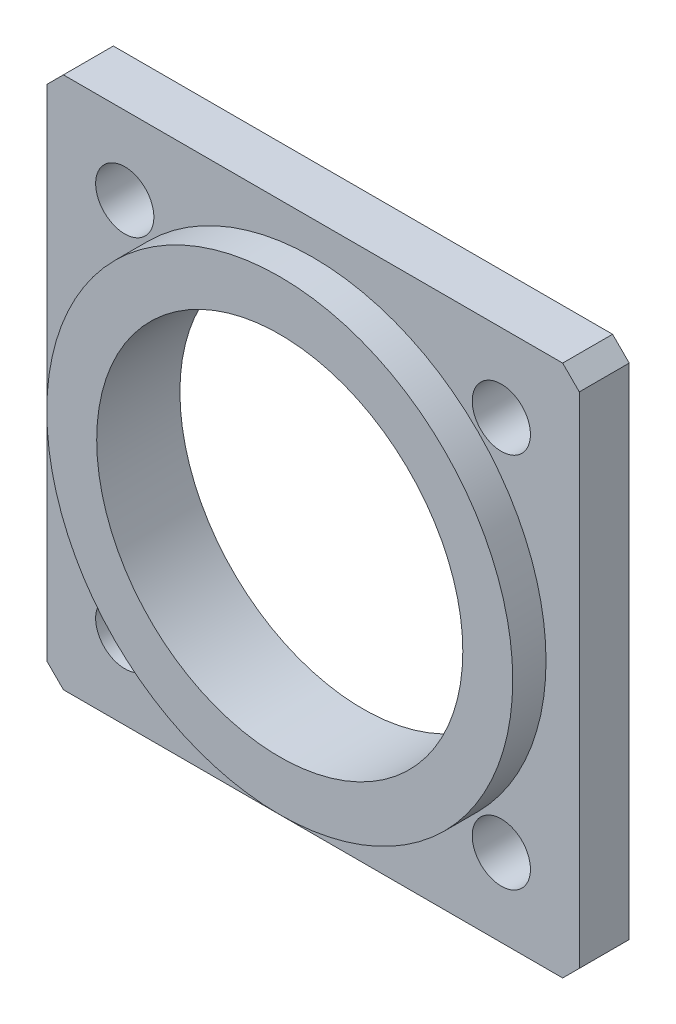
ISO-10303-21;
HEADER;
FILE_DESCRIPTION(('STEP AP214'),'2;1');
FILE_NAME('part.step','',(''),(''),'','','');
FILE_SCHEMA(('AUTOMOTIVE_DESIGN { 1 0 10303 214 1 1 1 1 }'));
ENDSEC;
DATA;
#1=APPLICATION_CONTEXT('core data for automotive mechanical design processes');
#2=APPLICATION_PROTOCOL_DEFINITION('international standard','automotive_design',2000,#1);
#3=PRODUCT_CONTEXT('',#1,'mechanical');
#4=PRODUCT('Part','Part','',(#3));
#5=PRODUCT_RELATED_PRODUCT_CATEGORY('part','',(#4));
#6=PRODUCT_DEFINITION_FORMATION('','',#4);
#7=PRODUCT_DEFINITION_CONTEXT('part definition',#1,'design');
#8=PRODUCT_DEFINITION('design','',#6,#7);
#9=PRODUCT_DEFINITION_SHAPE('','',#8);
#10=(LENGTH_UNIT() NAMED_UNIT(*) SI_UNIT(.MILLI.,.METRE.));
#11=(NAMED_UNIT(*) PLANE_ANGLE_UNIT() SI_UNIT($,.RADIAN.));
#12=(NAMED_UNIT(*) SI_UNIT($,.STERADIAN.) SOLID_ANGLE_UNIT());
#13=UNCERTAINTY_MEASURE_WITH_UNIT(LENGTH_MEASURE(1.E-05),#10,'distance_accuracy_value','');
#14=(GEOMETRIC_REPRESENTATION_CONTEXT(3) GLOBAL_UNCERTAINTY_ASSIGNED_CONTEXT((#13)) GLOBAL_UNIT_ASSIGNED_CONTEXT((#10,
#11,#12)) REPRESENTATION_CONTEXT('',''));
#15=CARTESIAN_POINT('',(0.,0.,0.));
#16=DIRECTION('',(0.,0.,1.));
#17=DIRECTION('',(1.,0.,0.));
#18=AXIS2_PLACEMENT_3D('',#15,#16,#17);
#19=CARTESIAN_POINT('',(0.,0.,5.));
#20=DIRECTION('',(0.,0.,-1.));
#21=DIRECTION('',(-1.,0.,0.));
#22=AXIS2_PLACEMENT_3D('',#19,#20,#21);
#23=CYLINDRICAL_SURFACE('',#22,14.);
#24=CARTESIAN_POINT('',(0.,0.,5.));
#25=DIRECTION('',(0.,0.,-1.));
#26=DIRECTION('',(-1.,0.,0.));
#27=AXIS2_PLACEMENT_3D('',#24,#25,#26);
#28=CIRCLE('',#27,14.);
#29=CARTESIAN_POINT('',(-14.,0.,5.));
#30=VERTEX_POINT('',#29);
#31=EDGE_CURVE('E20',#30,#30,#28,.F.);
#32=ORIENTED_EDGE('',*,*,#31,.F.);
#33=EDGE_LOOP('',(#32));
#34=FACE_BOUND('',#33,.T.);
#35=CARTESIAN_POINT('',(0.,0.,3.));
#36=DIRECTION('',(0.,0.,-1.));
#37=DIRECTION('',(-1.,0.,0.));
#38=AXIS2_PLACEMENT_3D('',#35,#36,#37);
#39=CIRCLE('',#38,14.);
#40=CARTESIAN_POINT('',(-14.,0.,3.));
#41=VERTEX_POINT('',#40);
#42=EDGE_CURVE('E95',#41,#41,#39,.F.);
#43=ORIENTED_EDGE('',*,*,#42,.T.);
#44=EDGE_LOOP('',(#43));
#45=FACE_BOUND('',#44,.T.);
#46=ADVANCED_FACE('F17',(#34,#45),#23,.T.);
#47=CARTESIAN_POINT('',(0.,0.,5.));
#48=DIRECTION('',(0.,0.,1.));
#49=DIRECTION('',(1.,0.,0.));
#50=AXIS2_PLACEMENT_3D('',#47,#48,#49);
#51=PLANE('',#50);
#52=ORIENTED_EDGE('',*,*,#31,.T.);
#53=EDGE_LOOP('',(#52));
#54=FACE_BOUND('',#53,.T.);
#55=CARTESIAN_POINT('',(0.,0.,5.));
#56=DIRECTION('',(0.,0.,1.));
#57=DIRECTION('',(1.,0.,0.));
#58=AXIS2_PLACEMENT_3D('',#55,#56,#57);
#59=CIRCLE('',#58,11.);
#60=CARTESIAN_POINT('',(11.,0.,5.));
#61=VERTEX_POINT('',#60);
#62=EDGE_CURVE('E118',#61,#61,#59,.F.);
#63=ORIENTED_EDGE('',*,*,#62,.T.);
#64=EDGE_LOOP('',(#63));
#65=FACE_BOUND('',#64,.T.);
#66=ADVANCED_FACE('F312',(#54,#65),#51,.T.);
#67=CARTESIAN_POINT('',(-16.,15.,3.));
#68=DIRECTION('',(0.707106781186548,-0.707106781186548,0.));
#69=DIRECTION('',(0.707106781186548,0.707106781186548,0.));
#70=AXIS2_PLACEMENT_3D('',#67,#68,#69);
#71=PLANE('',#70);
#72=DIRECTION('',(0.,0.,-1.));
#73=VECTOR('',#72,1.);
#74=CARTESIAN_POINT('',(-15.,16.,3.));
#75=LINE('',#74,#73);
#76=CARTESIAN_POINT('',(-15.,16.,3.));
#77=VERTEX_POINT('',#76);
#78=CARTESIAN_POINT('',(-15.,16.,0.));
#79=VERTEX_POINT('',#78);
#80=EDGE_CURVE('E104',#77,#79,#75,.T.);
#81=ORIENTED_EDGE('',*,*,#80,.T.);
#82=DIRECTION('',(0.707106781186548,0.707106781186548,0.));
#83=VECTOR('',#82,1.);
#84=CARTESIAN_POINT('',(-16.,15.,0.));
#85=LINE('',#84,#83);
#86=CARTESIAN_POINT('',(-16.,15.,0.));
#87=VERTEX_POINT('',#86);
#88=EDGE_CURVE('E127',#87,#79,#85,.T.);
#89=ORIENTED_EDGE('',*,*,#88,.F.);
#90=DIRECTION('',(0.,0.,-1.));
#91=VECTOR('',#90,1.);
#92=CARTESIAN_POINT('',(-16.,15.,3.));
#93=LINE('',#92,#91);
#94=CARTESIAN_POINT('',(-16.,15.,3.));
#95=VERTEX_POINT('',#94);
#96=EDGE_CURVE('E77',#87,#95,#93,.F.);
#97=ORIENTED_EDGE('',*,*,#96,.T.);
#98=DIRECTION('',(0.707106781186547,0.707106781186547,0.));
#99=VECTOR('',#98,1.);
#100=CARTESIAN_POINT('',(-16.,15.,3.));
#101=LINE('',#100,#99);
#102=EDGE_CURVE('E94',#95,#77,#101,.T.);
#103=ORIENTED_EDGE('',*,*,#102,.T.);
#104=EDGE_LOOP('',(#81,#89,#97,#103));
#105=FACE_BOUND('',#104,.T.);
#106=ADVANCED_FACE('F303',(#105),#71,.F.);
#107=CARTESIAN_POINT('',(15.,16.,3.));
#108=DIRECTION('',(-0.707106781186548,-0.707106781186548,0.));
#109=DIRECTION('',(0.707106781186548,-0.707106781186548,0.));
#110=AXIS2_PLACEMENT_3D('',#107,#108,#109);
#111=PLANE('',#110);
#112=DIRECTION('',(0.,0.,1.));
#113=VECTOR('',#112,1.);
#114=CARTESIAN_POINT('',(16.,15.,3.));
#115=LINE('',#114,#113);
#116=CARTESIAN_POINT('',(16.,15.,3.));
#117=VERTEX_POINT('',#116);
#118=CARTESIAN_POINT('',(16.,15.,0.));
#119=VERTEX_POINT('',#118);
#120=EDGE_CURVE('E365',#117,#119,#115,.F.);
#121=ORIENTED_EDGE('',*,*,#120,.T.);
#122=DIRECTION('',(0.707106781186548,-0.707106781186548,0.));
#123=VECTOR('',#122,1.);
#124=CARTESIAN_POINT('',(15.,16.,0.));
#125=LINE('',#124,#123);
#126=CARTESIAN_POINT('',(15.,16.,0.));
#127=VERTEX_POINT('',#126);
#128=EDGE_CURVE('E125',#127,#119,#125,.T.);
#129=ORIENTED_EDGE('',*,*,#128,.F.);
#130=DIRECTION('',(0.,0.,-1.));
#131=VECTOR('',#130,1.);
#132=CARTESIAN_POINT('',(15.,16.,3.));
#133=LINE('',#132,#131);
#134=CARTESIAN_POINT('',(15.,16.,3.));
#135=VERTEX_POINT('',#134);
#136=EDGE_CURVE('E347',#127,#135,#133,.F.);
#137=ORIENTED_EDGE('',*,*,#136,.T.);
#138=DIRECTION('',(0.707106781186546,-0.707106781186549,0.));
#139=VECTOR('',#138,1.);
#140=CARTESIAN_POINT('',(15.,16.,3.));
#141=LINE('',#140,#139);
#142=EDGE_CURVE('E119',#135,#117,#141,.T.);
#143=ORIENTED_EDGE('',*,*,#142,.T.);
#144=EDGE_LOOP('',(#121,#129,#137,#143));
#145=FACE_BOUND('',#144,.T.);
#146=ADVANCED_FACE('F294',(#145),#111,.F.);
#147=CARTESIAN_POINT('',(15.,-16.,3.));
#148=DIRECTION('',(-0.707106781186548,0.707106781186548,0.));
#149=DIRECTION('',(-0.707106781186548,-0.707106781186548,0.));
#150=AXIS2_PLACEMENT_3D('',#147,#148,#149);
#151=PLANE('',#150);
#152=DIRECTION('',(0.,0.,1.));
#153=VECTOR('',#152,1.);
#154=CARTESIAN_POINT('',(15.,-16.,3.));
#155=LINE('',#154,#153);
#156=CARTESIAN_POINT('',(15.,-16.,3.));
#157=VERTEX_POINT('',#156);
#158=CARTESIAN_POINT('',(15.,-16.,0.));
#159=VERTEX_POINT('',#158);
#160=EDGE_CURVE('E358',#157,#159,#155,.F.);
#161=ORIENTED_EDGE('',*,*,#160,.T.);
#162=DIRECTION('',(-0.707106781186548,-0.707106781186548,0.));
#163=VECTOR('',#162,1.);
#164=CARTESIAN_POINT('',(15.,-16.,0.));
#165=LINE('',#164,#163);
#166=CARTESIAN_POINT('',(16.,-15.,0.));
#167=VERTEX_POINT('',#166);
#168=EDGE_CURVE('E34',#167,#159,#165,.T.);
#169=ORIENTED_EDGE('',*,*,#168,.F.);
#170=DIRECTION('',(0.,0.,1.));
#171=VECTOR('',#170,1.);
#172=CARTESIAN_POINT('',(16.,-15.,3.));
#173=LINE('',#172,#171);
#174=CARTESIAN_POINT('',(16.,-15.,3.));
#175=VERTEX_POINT('',#174);
#176=EDGE_CURVE('E363',#167,#175,#173,.T.);
#177=ORIENTED_EDGE('',*,*,#176,.T.);
#178=DIRECTION('',(-0.707106781186549,-0.707106781186546,0.));
#179=VECTOR('',#178,1.);
#180=CARTESIAN_POINT('',(16.,-15.,3.));
#181=LINE('',#180,#179);
#182=EDGE_CURVE('E116',#175,#157,#181,.T.);
#183=ORIENTED_EDGE('',*,*,#182,.T.);
#184=EDGE_LOOP('',(#161,#169,#177,#183));
#185=FACE_BOUND('',#184,.T.);
#186=ADVANCED_FACE('F169',(#185),#151,.F.);
#187=CARTESIAN_POINT('',(-15.,-16.,3.));
#188=DIRECTION('',(0.707106781186548,0.707106781186548,0.));
#189=DIRECTION('',(-0.707106781186548,0.707106781186548,0.));
#190=AXIS2_PLACEMENT_3D('',#187,#188,#189);
#191=PLANE('',#190);
#192=DIRECTION('',(0.,0.,-1.));
#193=VECTOR('',#192,1.);
#194=CARTESIAN_POINT('',(-16.,-15.,3.));
#195=LINE('',#194,#193);
#196=CARTESIAN_POINT('',(-16.,-15.,3.));
#197=VERTEX_POINT('',#196);
#198=CARTESIAN_POINT('',(-16.,-15.,0.));
#199=VERTEX_POINT('',#198);
#200=EDGE_CURVE('E87',#197,#199,#195,.T.);
#201=ORIENTED_EDGE('',*,*,#200,.T.);
#202=DIRECTION('',(-0.707106781186548,0.707106781186548,0.));
#203=VECTOR('',#202,1.);
#204=CARTESIAN_POINT('',(-15.,-16.,0.));
#205=LINE('',#204,#203);
#206=CARTESIAN_POINT('',(-15.,-16.,0.));
#207=VERTEX_POINT('',#206);
#208=EDGE_CURVE('E122',#207,#199,#205,.T.);
#209=ORIENTED_EDGE('',*,*,#208,.F.);
#210=DIRECTION('',(0.,0.,1.));
#211=VECTOR('',#210,1.);
#212=CARTESIAN_POINT('',(-15.,-16.,3.));
#213=LINE('',#212,#211);
#214=CARTESIAN_POINT('',(-15.,-16.,3.));
#215=VERTEX_POINT('',#214);
#216=EDGE_CURVE('E90',#207,#215,#213,.T.);
#217=ORIENTED_EDGE('',*,*,#216,.T.);
#218=DIRECTION('',(-0.70710678118655,0.707106781186545,0.));
#219=VECTOR('',#218,1.);
#220=CARTESIAN_POINT('',(-15.,-16.,3.));
#221=LINE('',#220,#219);
#222=EDGE_CURVE('E83',#215,#197,#221,.T.);
#223=ORIENTED_EDGE('',*,*,#222,.T.);
#224=EDGE_LOOP('',(#201,#209,#217,#223));
#225=FACE_BOUND('',#224,.T.);
#226=ADVANCED_FACE('F85',(#225),#191,.F.);
#227=CARTESIAN_POINT('',(-16.,16.,3.));
#228=DIRECTION('',(0.,0.,-1.));
#229=DIRECTION('',(-1.,0.,0.));
#230=AXIS2_PLACEMENT_3D('',#227,#228,#229);
#231=PLANE('',#230);
#232=ORIENTED_EDGE('',*,*,#182,.F.);
#233=DIRECTION('',(0.,1.,0.));
#234=VECTOR('',#233,1.);
#235=CARTESIAN_POINT('',(16.,-15.,3.));
#236=LINE('',#235,#234);
#237=EDGE_CURVE('E360',#175,#117,#236,.T.);
#238=ORIENTED_EDGE('',*,*,#237,.T.);
#239=ORIENTED_EDGE('',*,*,#142,.F.);
#240=DIRECTION('',(1.,0.,0.));
#241=VECTOR('',#240,1.);
#242=CARTESIAN_POINT('',(-15.,16.,3.));
#243=LINE('',#242,#241);
#244=EDGE_CURVE('E368',#135,#77,#243,.F.);
#245=ORIENTED_EDGE('',*,*,#244,.T.);
#246=ORIENTED_EDGE('',*,*,#102,.F.);
#247=DIRECTION('',(0.,1.,0.));
#248=VECTOR('',#247,1.);
#249=CARTESIAN_POINT('',(-16.,-15.,3.));
#250=LINE('',#249,#248);
#251=EDGE_CURVE('E98',#95,#197,#250,.F.);
#252=ORIENTED_EDGE('',*,*,#251,.T.);
#253=ORIENTED_EDGE('',*,*,#222,.F.);
#254=DIRECTION('',(1.,0.,0.));
#255=VECTOR('',#254,1.);
#256=CARTESIAN_POINT('',(-15.,-16.,3.));
#257=LINE('',#256,#255);
#258=EDGE_CURVE('E143',#215,#157,#257,.T.);
#259=ORIENTED_EDGE('',*,*,#258,.T.);
#260=EDGE_LOOP('',(#232,#238,#239,#245,#246,#252,#253,#259));
#261=FACE_BOUND('',#260,.T.);
#262=CARTESIAN_POINT('',(-11.31370849898,-11.31370849898,3.));
#263=DIRECTION('',(0.,0.,1.));
#264=DIRECTION('',(1.,0.,0.));
#265=AXIS2_PLACEMENT_3D('',#262,#263,#264);
#266=CIRCLE('',#265,1.75);
#267=CARTESIAN_POINT('',(-9.56370849898,-11.31370849898,3.));
#268=VERTEX_POINT('',#267);
#269=EDGE_CURVE('E109',#268,#268,#266,.F.);
#270=ORIENTED_EDGE('',*,*,#269,.T.);
#271=EDGE_LOOP('',(#270));
#272=FACE_BOUND('',#271,.T.);
#273=CARTESIAN_POINT('',(11.31370849898,-11.31370849898,3.));
#274=DIRECTION('',(0.,0.,1.));
#275=DIRECTION('',(1.,0.,0.));
#276=AXIS2_PLACEMENT_3D('',#273,#274,#275);
#277=CIRCLE('',#276,1.75);
#278=CARTESIAN_POINT('',(13.06370849898,-11.31370849898,3.));
#279=VERTEX_POINT('',#278);
#280=EDGE_CURVE('E113',#279,#279,#277,.F.);
#281=ORIENTED_EDGE('',*,*,#280,.T.);
#282=EDGE_LOOP('',(#281));
#283=FACE_BOUND('',#282,.T.);
#284=CARTESIAN_POINT('',(11.31370849898,11.31370849898,3.));
#285=DIRECTION('',(0.,0.,1.));
#286=DIRECTION('',(1.,0.,0.));
#287=AXIS2_PLACEMENT_3D('',#284,#285,#286);
#288=CIRCLE('',#287,1.75);
#289=CARTESIAN_POINT('',(13.06370849898,11.31370849898,3.));
#290=VERTEX_POINT('',#289);
#291=EDGE_CURVE('E147',#290,#290,#288,.F.);
#292=ORIENTED_EDGE('',*,*,#291,.T.);
#293=EDGE_LOOP('',(#292));
#294=FACE_BOUND('',#293,.T.);
#295=CARTESIAN_POINT('',(-11.31370849898,11.31370849898,3.));
#296=DIRECTION('',(0.,0.,1.));
#297=DIRECTION('',(1.,0.,0.));
#298=AXIS2_PLACEMENT_3D('',#295,#296,#297);
#299=CIRCLE('',#298,1.75);
#300=CARTESIAN_POINT('',(-9.56370849898,11.31370849898,3.));
#301=VERTEX_POINT('',#300);
#302=EDGE_CURVE('E150',#301,#301,#299,.F.);
#303=ORIENTED_EDGE('',*,*,#302,.T.);
#304=EDGE_LOOP('',(#303));
#305=FACE_BOUND('',#304,.T.);
#306=ORIENTED_EDGE('',*,*,#42,.F.);
#307=EDGE_LOOP('',(#306));
#308=FACE_BOUND('',#307,.T.);
#309=ADVANCED_FACE('F100',(#261,#272,#283,#294,#305,#308),#231,.F.);
#310=CARTESIAN_POINT('',(0.,0.,0.));
#311=DIRECTION('',(0.,0.,1.));
#312=DIRECTION('',(1.,0.,0.));
#313=AXIS2_PLACEMENT_3D('',#310,#311,#312);
#314=CYLINDRICAL_SURFACE('',#313,11.);
#315=ORIENTED_EDGE('',*,*,#62,.F.);
#316=EDGE_LOOP('',(#315));
#317=FACE_BOUND('',#316,.T.);
#318=CARTESIAN_POINT('',(0.,0.,0.));
#319=DIRECTION('',(0.,0.,1.));
#320=DIRECTION('',(1.,0.,0.));
#321=AXIS2_PLACEMENT_3D('',#318,#319,#320);
#322=CIRCLE('',#321,11.);
#323=CARTESIAN_POINT('',(11.,0.,0.));
#324=VERTEX_POINT('',#323);
#325=EDGE_CURVE('E141',#324,#324,#322,.T.);
#326=ORIENTED_EDGE('',*,*,#325,.F.);
#327=EDGE_LOOP('',(#326));
#328=FACE_BOUND('',#327,.T.);
#329=ADVANCED_FACE('F159',(#317,#328),#314,.F.);
#330=CARTESIAN_POINT('',(-11.31370849898,11.31370849898,-2.));
#331=DIRECTION('',(0.,0.,1.));
#332=DIRECTION('',(1.,0.,0.));
#333=AXIS2_PLACEMENT_3D('',#330,#331,#332);
#334=CYLINDRICAL_SURFACE('',#333,1.75);
#335=ORIENTED_EDGE('',*,*,#302,.F.);
#336=EDGE_LOOP('',(#335));
#337=FACE_BOUND('',#336,.T.);
#338=CARTESIAN_POINT('',(-11.31370849898,11.31370849898,0.));
#339=DIRECTION('',(0.,0.,1.));
#340=DIRECTION('',(1.,0.,0.));
#341=AXIS2_PLACEMENT_3D('',#338,#339,#340);
#342=CIRCLE('',#341,1.75);
#343=CARTESIAN_POINT('',(-9.56370849898,11.31370849898,0.));
#344=VERTEX_POINT('',#343);
#345=EDGE_CURVE('E138',#344,#344,#342,.T.);
#346=ORIENTED_EDGE('',*,*,#345,.F.);
#347=EDGE_LOOP('',(#346));
#348=FACE_BOUND('',#347,.T.);
#349=ADVANCED_FACE('F166',(#337,#348),#334,.F.);
#350=CARTESIAN_POINT('',(11.31370849898,11.31370849898,-2.));
#351=DIRECTION('',(0.,0.,1.));
#352=DIRECTION('',(1.,0.,0.));
#353=AXIS2_PLACEMENT_3D('',#350,#351,#352);
#354=CYLINDRICAL_SURFACE('',#353,1.75);
#355=ORIENTED_EDGE('',*,*,#291,.F.);
#356=EDGE_LOOP('',(#355));
#357=FACE_BOUND('',#356,.T.);
#358=CARTESIAN_POINT('',(11.31370849898,11.31370849898,0.));
#359=DIRECTION('',(0.,0.,1.));
#360=DIRECTION('',(1.,0.,0.));
#361=AXIS2_PLACEMENT_3D('',#358,#359,#360);
#362=CIRCLE('',#361,1.75);
#363=CARTESIAN_POINT('',(13.06370849898,11.31370849898,0.));
#364=VERTEX_POINT('',#363);
#365=EDGE_CURVE('E135',#364,#364,#362,.T.);
#366=ORIENTED_EDGE('',*,*,#365,.F.);
#367=EDGE_LOOP('',(#366));
#368=FACE_BOUND('',#367,.T.);
#369=ADVANCED_FACE('F199',(#357,#368),#354,.F.);
#370=CARTESIAN_POINT('',(11.31370849898,-11.31370849898,-2.));
#371=DIRECTION('',(0.,0.,1.));
#372=DIRECTION('',(1.,0.,0.));
#373=AXIS2_PLACEMENT_3D('',#370,#371,#372);
#374=CYLINDRICAL_SURFACE('',#373,1.75);
#375=ORIENTED_EDGE('',*,*,#280,.F.);
#376=EDGE_LOOP('',(#375));
#377=FACE_BOUND('',#376,.T.);
#378=CARTESIAN_POINT('',(11.31370849898,-11.31370849898,0.));
#379=DIRECTION('',(0.,0.,1.));
#380=DIRECTION('',(1.,0.,0.));
#381=AXIS2_PLACEMENT_3D('',#378,#379,#380);
#382=CIRCLE('',#381,1.75);
#383=CARTESIAN_POINT('',(13.06370849898,-11.31370849898,0.));
#384=VERTEX_POINT('',#383);
#385=EDGE_CURVE('E132',#384,#384,#382,.T.);
#386=ORIENTED_EDGE('',*,*,#385,.F.);
#387=EDGE_LOOP('',(#386));
#388=FACE_BOUND('',#387,.T.);
#389=ADVANCED_FACE('F195',(#377,#388),#374,.F.);
#390=CARTESIAN_POINT('',(-11.31370849898,-11.31370849898,-2.));
#391=DIRECTION('',(0.,0.,1.));
#392=DIRECTION('',(1.,0.,0.));
#393=AXIS2_PLACEMENT_3D('',#390,#391,#392);
#394=CYLINDRICAL_SURFACE('',#393,1.75);
#395=ORIENTED_EDGE('',*,*,#269,.F.);
#396=EDGE_LOOP('',(#395));
#397=FACE_BOUND('',#396,.T.);
#398=CARTESIAN_POINT('',(-11.31370849898,-11.31370849898,0.));
#399=DIRECTION('',(0.,0.,1.));
#400=DIRECTION('',(1.,0.,0.));
#401=AXIS2_PLACEMENT_3D('',#398,#399,#400);
#402=CIRCLE('',#401,1.75);
#403=CARTESIAN_POINT('',(-9.56370849898,-11.31370849898,0.));
#404=VERTEX_POINT('',#403);
#405=EDGE_CURVE('E129',#404,#404,#402,.T.);
#406=ORIENTED_EDGE('',*,*,#405,.F.);
#407=EDGE_LOOP('',(#406));
#408=FACE_BOUND('',#407,.T.);
#409=ADVANCED_FACE('F192',(#397,#408),#394,.F.);
#410=CARTESIAN_POINT('',(-16.,-15.,3.));
#411=DIRECTION('',(1.,0.,0.));
#412=DIRECTION('',(0.,0.,-1.));
#413=AXIS2_PLACEMENT_3D('',#410,#411,#412);
#414=PLANE('',#413);
#415=ORIENTED_EDGE('',*,*,#96,.F.);
#416=DIRECTION('',(0.,1.,0.));
#417=VECTOR('',#416,1.);
#418=CARTESIAN_POINT('',(-16.,16.,0.));
#419=LINE('',#418,#417);
#420=EDGE_CURVE('E108',#199,#87,#419,.T.);
#421=ORIENTED_EDGE('',*,*,#420,.F.);
#422=ORIENTED_EDGE('',*,*,#200,.F.);
#423=ORIENTED_EDGE('',*,*,#251,.F.);
#424=EDGE_LOOP('',(#415,#421,#422,#423));
#425=FACE_BOUND('',#424,.T.);
#426=ADVANCED_FACE('F106',(#425),#414,.F.);
#427=CARTESIAN_POINT('',(-15.,16.,3.));
#428=DIRECTION('',(0.,-1.,0.));
#429=DIRECTION('',(0.,0.,-1.));
#430=AXIS2_PLACEMENT_3D('',#427,#428,#429);
#431=PLANE('',#430);
#432=ORIENTED_EDGE('',*,*,#136,.F.);
#433=DIRECTION('',(-1.,0.,0.));
#434=VECTOR('',#433,1.);
#435=CARTESIAN_POINT('',(-16.,16.,0.));
#436=LINE('',#435,#434);
#437=EDGE_CURVE('E351',#79,#127,#436,.F.);
#438=ORIENTED_EDGE('',*,*,#437,.F.);
#439=ORIENTED_EDGE('',*,*,#80,.F.);
#440=ORIENTED_EDGE('',*,*,#244,.F.);
#441=EDGE_LOOP('',(#432,#438,#439,#440));
#442=FACE_BOUND('',#441,.T.);
#443=ADVANCED_FACE('F185',(#442),#431,.F.);
#444=CARTESIAN_POINT('',(16.,-15.,3.));
#445=DIRECTION('',(-1.,0.,0.));
#446=DIRECTION('',(0.,0.,1.));
#447=AXIS2_PLACEMENT_3D('',#444,#445,#446);
#448=PLANE('',#447);
#449=ORIENTED_EDGE('',*,*,#176,.F.);
#450=DIRECTION('',(0.,1.,0.));
#451=VECTOR('',#450,1.);
#452=CARTESIAN_POINT('',(16.,16.,0.));
#453=LINE('',#452,#451);
#454=EDGE_CURVE('E26',#119,#167,#453,.F.);
#455=ORIENTED_EDGE('',*,*,#454,.F.);
#456=ORIENTED_EDGE('',*,*,#120,.F.);
#457=ORIENTED_EDGE('',*,*,#237,.F.);
#458=EDGE_LOOP('',(#449,#455,#456,#457));
#459=FACE_BOUND('',#458,.T.);
#460=ADVANCED_FACE('F178',(#459),#448,.F.);
#461=CARTESIAN_POINT('',(-15.,-16.,3.));
#462=DIRECTION('',(0.,1.,0.));
#463=DIRECTION('',(0.,0.,1.));
#464=AXIS2_PLACEMENT_3D('',#461,#462,#463);
#465=PLANE('',#464);
#466=ORIENTED_EDGE('',*,*,#216,.F.);
#467=DIRECTION('',(-1.,0.,0.));
#468=VECTOR('',#467,1.);
#469=CARTESIAN_POINT('',(-16.,-16.,0.));
#470=LINE('',#469,#468);
#471=EDGE_CURVE('E11',#159,#207,#470,.T.);
#472=ORIENTED_EDGE('',*,*,#471,.F.);
#473=ORIENTED_EDGE('',*,*,#160,.F.);
#474=ORIENTED_EDGE('',*,*,#258,.F.);
#475=EDGE_LOOP('',(#466,#472,#473,#474));
#476=FACE_BOUND('',#475,.T.);
#477=ADVANCED_FACE('F173',(#476),#465,.F.);
#478=CARTESIAN_POINT('',(-16.,16.,0.));
#479=DIRECTION('',(0.,0.,-1.));
#480=DIRECTION('',(-1.,0.,0.));
#481=AXIS2_PLACEMENT_3D('',#478,#479,#480);
#482=PLANE('',#481);
#483=ORIENTED_EDGE('',*,*,#168,.T.);
#484=ORIENTED_EDGE('',*,*,#471,.T.);
#485=ORIENTED_EDGE('',*,*,#208,.T.);
#486=ORIENTED_EDGE('',*,*,#420,.T.);
#487=ORIENTED_EDGE('',*,*,#88,.T.);
#488=ORIENTED_EDGE('',*,*,#437,.T.);
#489=ORIENTED_EDGE('',*,*,#128,.T.);
#490=ORIENTED_EDGE('',*,*,#454,.T.);
#491=EDGE_LOOP('',(#483,#484,#485,#486,#487,#488,#489,#490));
#492=FACE_BOUND('',#491,.T.);
#493=ORIENTED_EDGE('',*,*,#405,.T.);
#494=EDGE_LOOP('',(#493));
#495=FACE_BOUND('',#494,.T.);
#496=ORIENTED_EDGE('',*,*,#385,.T.);
#497=EDGE_LOOP('',(#496));
#498=FACE_BOUND('',#497,.T.);
#499=ORIENTED_EDGE('',*,*,#365,.T.);
#500=EDGE_LOOP('',(#499));
#501=FACE_BOUND('',#500,.T.);
#502=ORIENTED_EDGE('',*,*,#345,.T.);
#503=EDGE_LOOP('',(#502));
#504=FACE_BOUND('',#503,.T.);
#505=ORIENTED_EDGE('',*,*,#325,.T.);
#506=EDGE_LOOP('',(#505));
#507=FACE_BOUND('',#506,.T.);
#508=ADVANCED_FACE('F171',(#492,#495,#498,#501,#504,#507),#482,.T.);
#509=CLOSED_SHELL('',(#46,#66,#106,#146,#186,#226,#309,#329,#349,#369,#389,#409,#426,#443,#460,
#477,#508));
#510=MANIFOLD_SOLID_BREP('B1',#509);
#511=ADVANCED_BREP_SHAPE_REPRESENTATION('',(#18,#510),#14);
#512=SHAPE_DEFINITION_REPRESENTATION(#9,#511);
ENDSEC;
END-ISO-10303-21;
